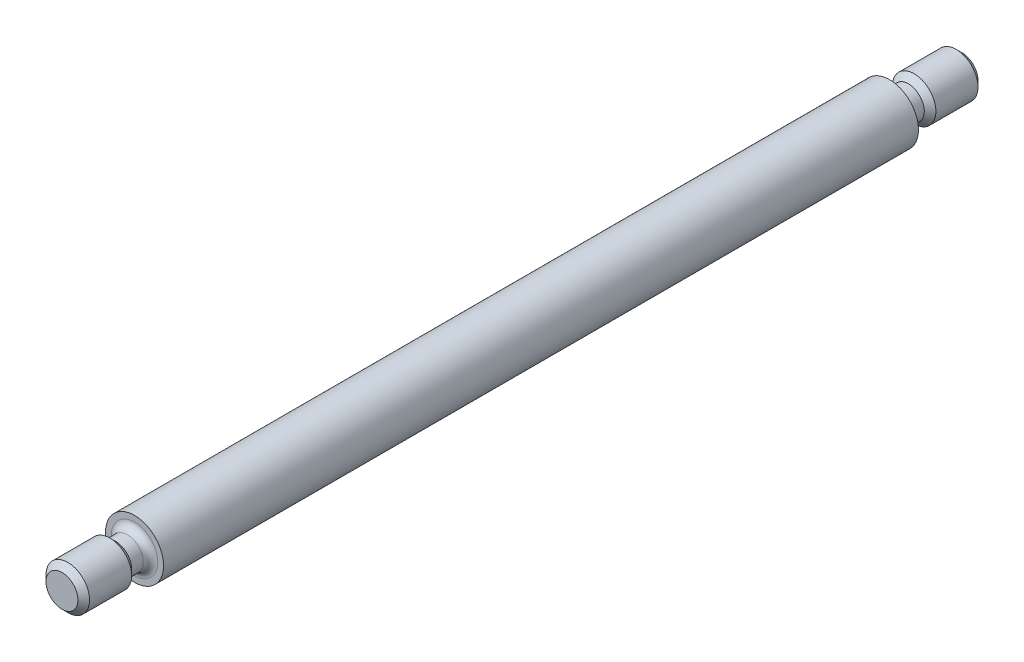
ISO-10303-21;
HEADER;
FILE_DESCRIPTION(('STEP AP214'),'2;1');
FILE_NAME('part.step','',(''),(''),'','','');
FILE_SCHEMA(('AUTOMOTIVE_DESIGN { 1 0 10303 214 1 1 1 1 }'));
ENDSEC;
DATA;
#1=APPLICATION_CONTEXT('core data for automotive mechanical design processes');
#2=APPLICATION_PROTOCOL_DEFINITION('international standard','automotive_design',2000,#1);
#3=PRODUCT_CONTEXT('',#1,'mechanical');
#4=PRODUCT('Part','Part','',(#3));
#5=PRODUCT_RELATED_PRODUCT_CATEGORY('part','',(#4));
#6=PRODUCT_DEFINITION_FORMATION('','',#4);
#7=PRODUCT_DEFINITION_CONTEXT('part definition',#1,'design');
#8=PRODUCT_DEFINITION('design','',#6,#7);
#9=PRODUCT_DEFINITION_SHAPE('','',#8);
#10=(LENGTH_UNIT() NAMED_UNIT(*) SI_UNIT(.MILLI.,.METRE.));
#11=(NAMED_UNIT(*) PLANE_ANGLE_UNIT() SI_UNIT($,.RADIAN.));
#12=(NAMED_UNIT(*) SI_UNIT($,.STERADIAN.) SOLID_ANGLE_UNIT());
#13=UNCERTAINTY_MEASURE_WITH_UNIT(LENGTH_MEASURE(1.E-05),#10,'distance_accuracy_value','');
#14=(GEOMETRIC_REPRESENTATION_CONTEXT(3) GLOBAL_UNCERTAINTY_ASSIGNED_CONTEXT((#13)) GLOBAL_UNIT_ASSIGNED_CONTEXT((#10,
#11,#12)) REPRESENTATION_CONTEXT('',''));
#15=CARTESIAN_POINT('',(0.,0.,0.));
#16=DIRECTION('',(0.,0.,1.));
#17=DIRECTION('',(1.,0.,0.));
#18=AXIS2_PLACEMENT_3D('',#15,#16,#17);
#19=CARTESIAN_POINT('',(-1.99999999999999,0.,26.));
#20=DIRECTION('',(0.,0.,1.));
#21=DIRECTION('',(1.,0.,0.));
#22=AXIS2_PLACEMENT_3D('',#19,#20,#21);
#23=PLANE('',#22);
#24=CARTESIAN_POINT('',(0.,0.,26.));
#25=DIRECTION('',(0.,0.,1.));
#26=DIRECTION('',(1.,0.,0.));
#27=AXIS2_PLACEMENT_3D('',#24,#25,#26);
#28=CIRCLE('',#27,1.60000000000001);
#29=CARTESIAN_POINT('',(1.60000000000002,0.,26.));
#30=VERTEX_POINT('',#29);
#31=EDGE_CURVE('E48',#30,#30,#28,.F.);
#32=ORIENTED_EDGE('',*,*,#31,.T.);
#33=EDGE_LOOP('',(#32));
#34=FACE_BOUND('',#33,.T.);
#35=CARTESIAN_POINT('',(0.,0.,26.));
#36=DIRECTION('',(0.,0.,-1.));
#37=DIRECTION('',(-1.,0.,0.));
#38=AXIS2_PLACEMENT_3D('',#35,#36,#37);
#39=CIRCLE('',#38,2.);
#40=CARTESIAN_POINT('',(-1.99999999999999,0.,26.));
#41=VERTEX_POINT('',#40);
#42=EDGE_CURVE('E71',#41,#41,#39,.T.);
#43=ORIENTED_EDGE('',*,*,#42,.F.);
#44=EDGE_LOOP('',(#43));
#45=FACE_BOUND('',#44,.T.);
#46=ADVANCED_FACE('F33',(#34,#45),#23,.T.);
#47=CARTESIAN_POINT('',(0.,0.,-31.));
#48=DIRECTION('',(0.,0.,-1.));
#49=DIRECTION('',(-1.,0.,0.));
#50=AXIS2_PLACEMENT_3D('',#47,#48,#49);
#51=CYLINDRICAL_SURFACE('',#50,2.);
#52=ORIENTED_EDGE('',*,*,#42,.T.);
#53=EDGE_LOOP('',(#52));
#54=FACE_BOUND('',#53,.T.);
#55=CARTESIAN_POINT('',(0.,0.,-26.));
#56=DIRECTION('',(0.,0.,-1.));
#57=DIRECTION('',(-1.,0.,0.));
#58=AXIS2_PLACEMENT_3D('',#55,#56,#57);
#59=CIRCLE('',#58,2.);
#60=CARTESIAN_POINT('',(-2.00000000000001,0.,-26.));
#61=VERTEX_POINT('',#60);
#62=EDGE_CURVE('E74',#61,#61,#59,.T.);
#63=ORIENTED_EDGE('',*,*,#62,.F.);
#64=EDGE_LOOP('',(#63));
#65=FACE_BOUND('',#64,.T.);
#66=ADVANCED_FACE('F102',(#54,#65),#51,.T.);
#67=CARTESIAN_POINT('',(-2.,0.,-26.));
#68=DIRECTION('',(0.,0.,-1.));
#69=DIRECTION('',(-1.,0.,0.));
#70=AXIS2_PLACEMENT_3D('',#67,#68,#69);
#71=PLANE('',#70);
#72=CARTESIAN_POINT('',(0.,0.,-26.));
#73=DIRECTION('',(0.,0.,-1.));
#74=DIRECTION('',(-1.,0.,0.));
#75=AXIS2_PLACEMENT_3D('',#72,#73,#74);
#76=CIRCLE('',#75,1.60000000000001);
#77=CARTESIAN_POINT('',(-1.60000000000001,0.,-26.));
#78=VERTEX_POINT('',#77);
#79=EDGE_CURVE('E10',#78,#78,#76,.F.);
#80=ORIENTED_EDGE('',*,*,#79,.T.);
#81=EDGE_LOOP('',(#80));
#82=FACE_BOUND('',#81,.T.);
#83=ORIENTED_EDGE('',*,*,#62,.T.);
#84=EDGE_LOOP('',(#83));
#85=FACE_BOUND('',#84,.T.);
#86=ADVANCED_FACE('F108',(#82,#85),#71,.T.);
#87=CARTESIAN_POINT('',(0.,0.,-31.));
#88=DIRECTION('',(0.,0.,-1.));
#89=DIRECTION('',(-1.,0.,0.));
#90=AXIS2_PLACEMENT_3D('',#87,#88,#89);
#91=CYLINDRICAL_SURFACE('',#90,1.10000000000001);
#92=CARTESIAN_POINT('',(0.,0.,-26.5));
#93=DIRECTION('',(0.,0.,-1.));
#94=DIRECTION('',(-1.,0.,0.));
#95=AXIS2_PLACEMENT_3D('',#92,#93,#94);
#96=CIRCLE('',#95,1.10000000000001);
#97=CARTESIAN_POINT('',(-1.10000000000001,0.,-26.5));
#98=VERTEX_POINT('',#97);
#99=EDGE_CURVE('E40',#98,#98,#96,.T.);
#100=ORIENTED_EDGE('',*,*,#99,.T.);
#101=EDGE_LOOP('',(#100));
#102=FACE_BOUND('',#101,.T.);
#103=CARTESIAN_POINT('',(0.,0.,-27.3));
#104=DIRECTION('',(0.,0.,-1.));
#105=DIRECTION('',(-1.,0.,0.));
#106=AXIS2_PLACEMENT_3D('',#103,#104,#105);
#107=CIRCLE('',#106,1.10000000000001);
#108=CARTESIAN_POINT('',(-1.10000000000001,0.,-27.3));
#109=VERTEX_POINT('',#108);
#110=EDGE_CURVE('E77',#109,#109,#107,.T.);
#111=ORIENTED_EDGE('',*,*,#110,.F.);
#112=EDGE_LOOP('',(#111));
#113=FACE_BOUND('',#112,.T.);
#114=ADVANCED_FACE('F147',(#102,#113),#91,.T.);
#115=CARTESIAN_POINT('',(0.,0.,-31.));
#116=DIRECTION('',(0.,0.,-1.));
#117=DIRECTION('',(-1.,0.,0.));
#118=AXIS2_PLACEMENT_3D('',#115,#116,#117);
#119=CYLINDRICAL_SURFACE('',#118,1.5);
#120=CARTESIAN_POINT('',(0.,0.,-27.7));
#121=DIRECTION('',(0.,0.,1.));
#122=DIRECTION('',(1.,0.,0.));
#123=AXIS2_PLACEMENT_3D('',#120,#121,#122);
#124=CIRCLE('',#123,1.5);
#125=CARTESIAN_POINT('',(1.49999999999999,0.,-27.7));
#126=VERTEX_POINT('',#125);
#127=EDGE_CURVE('E56',#126,#126,#124,.F.);
#128=ORIENTED_EDGE('',*,*,#127,.T.);
#129=EDGE_LOOP('',(#128));
#130=FACE_BOUND('',#129,.T.);
#131=CARTESIAN_POINT('',(0.,0.,-30.6));
#132=DIRECTION('',(0.,0.,-1.));
#133=DIRECTION('',(-1.,0.,0.));
#134=AXIS2_PLACEMENT_3D('',#131,#132,#133);
#135=CIRCLE('',#134,1.5);
#136=CARTESIAN_POINT('',(-1.50000000000001,0.,-30.6));
#137=VERTEX_POINT('',#136);
#138=EDGE_CURVE('E65',#137,#137,#135,.F.);
#139=ORIENTED_EDGE('',*,*,#138,.T.);
#140=EDGE_LOOP('',(#139));
#141=FACE_BOUND('',#140,.T.);
#142=ADVANCED_FACE('F143',(#130,#141),#119,.T.);
#143=CARTESIAN_POINT('',(0.,0.,-31.));
#144=DIRECTION('',(0.,0.,-1.));
#145=DIRECTION('',(-1.,0.,0.));
#146=AXIS2_PLACEMENT_3D('',#143,#144,#145);
#147=PLANE('',#146);
#148=CARTESIAN_POINT('',(0.,0.,-31.));
#149=DIRECTION('',(0.,0.,-1.));
#150=DIRECTION('',(-1.,0.,0.));
#151=AXIS2_PLACEMENT_3D('',#148,#149,#150);
#152=CIRCLE('',#151,1.10000000000001);
#153=CARTESIAN_POINT('',(-1.10000000000002,0.,-31.));
#154=VERTEX_POINT('',#153);
#155=EDGE_CURVE('E68',#154,#154,#152,.T.);
#156=ORIENTED_EDGE('',*,*,#155,.T.);
#157=EDGE_LOOP('',(#156));
#158=FACE_BOUND('',#157,.T.);
#159=ADVANCED_FACE('F137',(#158),#147,.T.);
#160=CARTESIAN_POINT('',(0.,0.,31.));
#161=DIRECTION('',(0.,0.,1.));
#162=DIRECTION('',(1.,0.,0.));
#163=AXIS2_PLACEMENT_3D('',#160,#161,#162);
#164=PLANE('',#163);
#165=CARTESIAN_POINT('',(0.,0.,31.));
#166=DIRECTION('',(0.,0.,1.));
#167=DIRECTION('',(1.,0.,0.));
#168=AXIS2_PLACEMENT_3D('',#165,#166,#167);
#169=CIRCLE('',#168,1.10000000000001);
#170=CARTESIAN_POINT('',(1.10000000000002,0.,31.));
#171=VERTEX_POINT('',#170);
#172=EDGE_CURVE('E59',#171,#171,#169,.T.);
#173=ORIENTED_EDGE('',*,*,#172,.T.);
#174=EDGE_LOOP('',(#173));
#175=FACE_BOUND('',#174,.T.);
#176=ADVANCED_FACE('F128',(#175),#164,.T.);
#177=CARTESIAN_POINT('',(0.,0.,-31.));
#178=DIRECTION('',(0.,0.,-1.));
#179=DIRECTION('',(-1.,0.,0.));
#180=AXIS2_PLACEMENT_3D('',#177,#178,#179);
#181=CYLINDRICAL_SURFACE('',#180,1.5);
#182=CARTESIAN_POINT('',(0.,0.,27.7));
#183=DIRECTION('',(0.,0.,-1.));
#184=DIRECTION('',(-1.,0.,0.));
#185=AXIS2_PLACEMENT_3D('',#182,#183,#184);
#186=CIRCLE('',#185,1.5);
#187=CARTESIAN_POINT('',(-1.49999999999999,0.,27.7));
#188=VERTEX_POINT('',#187);
#189=EDGE_CURVE('E53',#188,#188,#186,.F.);
#190=ORIENTED_EDGE('',*,*,#189,.T.);
#191=EDGE_LOOP('',(#190));
#192=FACE_BOUND('',#191,.T.);
#193=CARTESIAN_POINT('',(0.,0.,30.6));
#194=DIRECTION('',(0.,0.,1.));
#195=DIRECTION('',(1.,0.,0.));
#196=AXIS2_PLACEMENT_3D('',#193,#194,#195);
#197=CIRCLE('',#196,1.5);
#198=CARTESIAN_POINT('',(1.50000000000001,0.,30.6));
#199=VERTEX_POINT('',#198);
#200=EDGE_CURVE('E62',#199,#199,#197,.F.);
#201=ORIENTED_EDGE('',*,*,#200,.T.);
#202=EDGE_LOOP('',(#201));
#203=FACE_BOUND('',#202,.T.);
#204=ADVANCED_FACE('F126',(#192,#203),#181,.T.);
#205=CARTESIAN_POINT('',(0.,0.,-31.));
#206=DIRECTION('',(0.,0.,-1.));
#207=DIRECTION('',(-1.,0.,0.));
#208=AXIS2_PLACEMENT_3D('',#205,#206,#207);
#209=CYLINDRICAL_SURFACE('',#208,1.10000000000001);
#210=CARTESIAN_POINT('',(0.,0.,26.5));
#211=DIRECTION('',(0.,0.,1.));
#212=DIRECTION('',(1.,0.,0.));
#213=AXIS2_PLACEMENT_3D('',#210,#211,#212);
#214=CIRCLE('',#213,1.10000000000001);
#215=CARTESIAN_POINT('',(1.10000000000002,0.,26.5));
#216=VERTEX_POINT('',#215);
#217=EDGE_CURVE('E44',#216,#216,#214,.T.);
#218=ORIENTED_EDGE('',*,*,#217,.T.);
#219=EDGE_LOOP('',(#218));
#220=FACE_BOUND('',#219,.T.);
#221=CARTESIAN_POINT('',(0.,0.,27.3));
#222=DIRECTION('',(0.,0.,-1.));
#223=DIRECTION('',(-1.,0.,0.));
#224=AXIS2_PLACEMENT_3D('',#221,#222,#223);
#225=CIRCLE('',#224,1.10000000000001);
#226=CARTESIAN_POINT('',(-1.1,0.,27.3));
#227=VERTEX_POINT('',#226);
#228=EDGE_CURVE('E80',#227,#227,#225,.T.);
#229=ORIENTED_EDGE('',*,*,#228,.T.);
#230=EDGE_LOOP('',(#229));
#231=FACE_BOUND('',#230,.T.);
#232=ADVANCED_FACE('F84',(#220,#231),#209,.T.);
#233=CARTESIAN_POINT('',(0.,0.,-31.));
#234=DIRECTION('',(0.,0.,1.));
#235=DIRECTION('',(1.,0.,0.));
#236=AXIS2_PLACEMENT_3D('',#233,#234,#235);
#237=CONICAL_SURFACE('',#236,1.10000000000001,0.785398163397457);
#238=ORIENTED_EDGE('',*,*,#138,.F.);
#239=EDGE_LOOP('',(#238));
#240=FACE_BOUND('',#239,.T.);
#241=ORIENTED_EDGE('',*,*,#155,.F.);
#242=EDGE_LOOP('',(#241));
#243=FACE_BOUND('',#242,.T.);
#244=ADVANCED_FACE('F114',(#240,#243),#237,.T.);
#245=CARTESIAN_POINT('',(0.,0.,30.6));
#246=DIRECTION('',(0.,0.,-1.));
#247=DIRECTION('',(-1.,0.,0.));
#248=AXIS2_PLACEMENT_3D('',#245,#246,#247);
#249=CONICAL_SURFACE('',#248,1.5,0.785398163397456);
#250=ORIENTED_EDGE('',*,*,#172,.F.);
#251=EDGE_LOOP('',(#250));
#252=FACE_BOUND('',#251,.T.);
#253=ORIENTED_EDGE('',*,*,#200,.F.);
#254=EDGE_LOOP('',(#253));
#255=FACE_BOUND('',#254,.T.);
#256=ADVANCED_FACE('F97',(#252,#255),#249,.T.);
#257=CARTESIAN_POINT('',(0.,0.,-27.7));
#258=DIRECTION('',(0.,0.,-1.));
#259=DIRECTION('',(-1.,0.,0.));
#260=AXIS2_PLACEMENT_3D('',#257,#258,#259);
#261=CONICAL_SURFACE('',#260,1.5,0.785398163397447);
#262=ORIENTED_EDGE('',*,*,#110,.T.);
#263=EDGE_LOOP('',(#262));
#264=FACE_BOUND('',#263,.T.);
#265=ORIENTED_EDGE('',*,*,#127,.F.);
#266=EDGE_LOOP('',(#265));
#267=FACE_BOUND('',#266,.T.);
#268=ADVANCED_FACE('F89',(#264,#267),#261,.T.);
#269=CARTESIAN_POINT('',(0.,0.,27.3));
#270=DIRECTION('',(0.,0.,1.));
#271=DIRECTION('',(1.,0.,0.));
#272=AXIS2_PLACEMENT_3D('',#269,#270,#271);
#273=CONICAL_SURFACE('',#272,1.1,0.785398163397439);
#274=ORIENTED_EDGE('',*,*,#189,.F.);
#275=EDGE_LOOP('',(#274));
#276=FACE_BOUND('',#275,.T.);
#277=ORIENTED_EDGE('',*,*,#228,.F.);
#278=EDGE_LOOP('',(#277));
#279=FACE_BOUND('',#278,.T.);
#280=ADVANCED_FACE('F86',(#276,#279),#273,.T.);
#281=CARTESIAN_POINT('',(0.,0.,26.5));
#282=DIRECTION('',(0.,0.,1.));
#283=DIRECTION('',(1.,0.,0.));
#284=AXIS2_PLACEMENT_3D('',#281,#282,#283);
#285=TOROIDAL_SURFACE('',#284,1.60000000000001,0.5);
#286=ORIENTED_EDGE('',*,*,#217,.F.);
#287=EDGE_LOOP('',(#286));
#288=FACE_BOUND('',#287,.T.);
#289=ORIENTED_EDGE('',*,*,#31,.F.);
#290=EDGE_LOOP('',(#289));
#291=FACE_BOUND('',#290,.T.);
#292=ADVANCED_FACE('F88',(#288,#291),#285,.F.);
#293=CARTESIAN_POINT('',(0.,0.,-26.5));
#294=DIRECTION('',(0.,0.,-1.));
#295=DIRECTION('',(-1.,0.,0.));
#296=AXIS2_PLACEMENT_3D('',#293,#294,#295);
#297=TOROIDAL_SURFACE('',#296,1.60000000000001,0.5);
#298=ORIENTED_EDGE('',*,*,#79,.F.);
#299=EDGE_LOOP('',(#298));
#300=FACE_BOUND('',#299,.T.);
#301=ORIENTED_EDGE('',*,*,#99,.F.);
#302=EDGE_LOOP('',(#301));
#303=FACE_BOUND('',#302,.T.);
#304=ADVANCED_FACE('F35',(#300,#303),#297,.F.);
#305=CLOSED_SHELL('',(#46,#66,#86,#114,#142,#159,#176,#204,#232,#244,#256,#268,#280,#292,#304));
#306=MANIFOLD_SOLID_BREP('B2',#305);
#307=ADVANCED_BREP_SHAPE_REPRESENTATION('',(#18,#306),#14);
#308=SHAPE_DEFINITION_REPRESENTATION(#9,#307);
ENDSEC;
END-ISO-10303-21;
